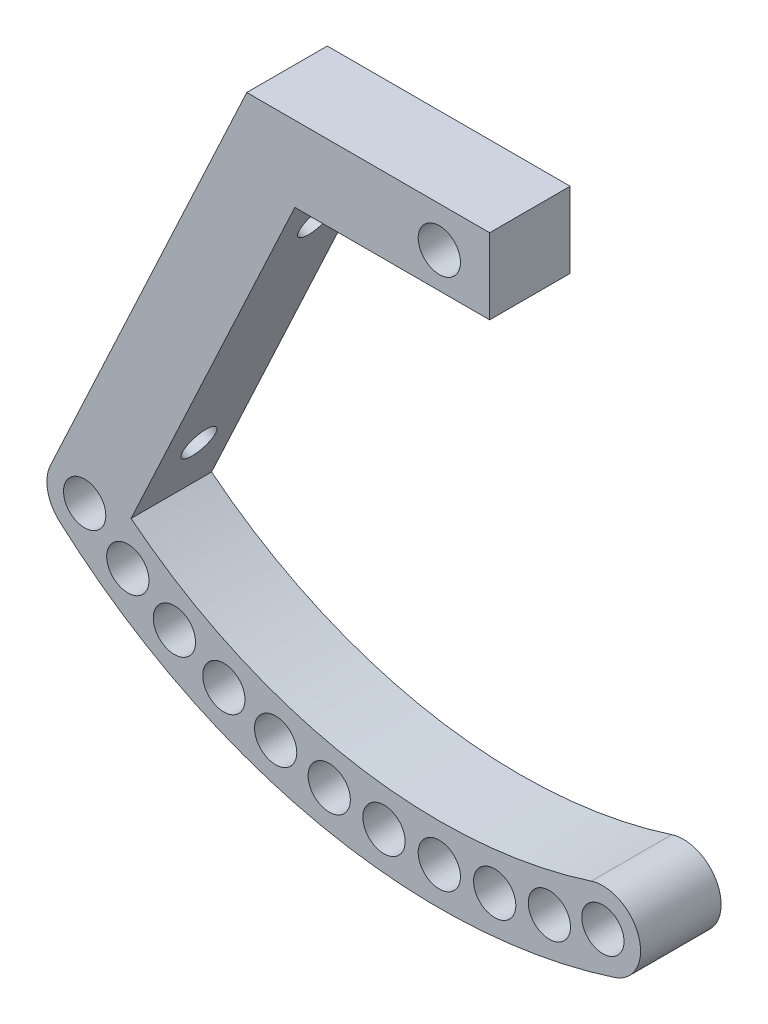
ISO-10303-21;
HEADER;
FILE_DESCRIPTION(('STEP AP214'),'2;1');
FILE_NAME('part.step','',(''),(''),'','','');
FILE_SCHEMA(('AUTOMOTIVE_DESIGN { 1 0 10303 214 1 1 1 1 }'));
ENDSEC;
DATA;
#1=APPLICATION_CONTEXT('core data for automotive mechanical design processes');
#2=APPLICATION_PROTOCOL_DEFINITION('international standard','automotive_design',2000,#1);
#3=PRODUCT_CONTEXT('',#1,'mechanical');
#4=PRODUCT('Part','Part','',(#3));
#5=PRODUCT_RELATED_PRODUCT_CATEGORY('part','',(#4));
#6=PRODUCT_DEFINITION_FORMATION('','',#4);
#7=PRODUCT_DEFINITION_CONTEXT('part definition',#1,'design');
#8=PRODUCT_DEFINITION('design','',#6,#7);
#9=PRODUCT_DEFINITION_SHAPE('','',#8);
#10=(LENGTH_UNIT() NAMED_UNIT(*) SI_UNIT(.MILLI.,.METRE.));
#11=(NAMED_UNIT(*) PLANE_ANGLE_UNIT() SI_UNIT($,.RADIAN.));
#12=(NAMED_UNIT(*) SI_UNIT($,.STERADIAN.) SOLID_ANGLE_UNIT());
#13=UNCERTAINTY_MEASURE_WITH_UNIT(LENGTH_MEASURE(1.E-05),#10,'distance_accuracy_value','');
#14=(GEOMETRIC_REPRESENTATION_CONTEXT(3) GLOBAL_UNCERTAINTY_ASSIGNED_CONTEXT((#13)) GLOBAL_UNIT_ASSIGNED_CONTEXT((#10,
#11,#12)) REPRESENTATION_CONTEXT('',''));
#15=CARTESIAN_POINT('',(0.,0.,0.));
#16=DIRECTION('',(0.,0.,1.));
#17=DIRECTION('',(1.,0.,0.));
#18=AXIS2_PLACEMENT_3D('',#15,#16,#17);
#19=CARTESIAN_POINT('',(-46.3566792332797,21.616474533113,8.));
#20=DIRECTION('',(0.906307787036651,-0.422618261740697,0.));
#21=DIRECTION('',(0.422618261740697,0.906307787036651,0.));
#22=AXIS2_PLACEMENT_3D('',#19,#20,#21);
#23=PLANE('',#22);
#24=CARTESIAN_POINT('',(-23.094691175394,71.5019689080599,4.));
#25=DIRECTION('',(-0.906307787036651,0.422618261740697,0.));
#26=DIRECTION('',(-0.422618261740697,-0.906307787036651,0.));
#27=AXIS2_PLACEMENT_3D('',#24,#25,#26);
#28=CIRCLE('',#27,1.65);
#29=CARTESIAN_POINT('',(-23.7920113072661,70.0065610594495,4.));
#30=VERTEX_POINT('',#29);
#31=EDGE_CURVE('E178',#30,#30,#28,.T.);
#32=ORIENTED_EDGE('',*,*,#31,.F.);
#33=EDGE_LOOP('',(#32));
#34=FACE_BOUND('',#33,.T.);
#35=CARTESIAN_POINT('',(-34.6744315470891,46.6691355432557,4.));
#36=DIRECTION('',(-0.906307787036651,0.422618261740697,0.));
#37=DIRECTION('',(-0.422618261740697,-0.906307787036651,0.));
#38=AXIS2_PLACEMENT_3D('',#35,#36,#37);
#39=CIRCLE('',#38,1.65);
#40=CARTESIAN_POINT('',(-35.3717516789612,45.1737276946452,4.));
#41=VERTEX_POINT('',#40);
#42=EDGE_CURVE('E267',#41,#41,#39,.T.);
#43=ORIENTED_EDGE('',*,*,#42,.F.);
#44=EDGE_LOOP('',(#43));
#45=FACE_BOUND('',#44,.T.);
#46=DIRECTION('',(-0.422618261740697,-0.906307787036651,0.));
#47=VECTOR('',#46,1.);
#48=CARTESIAN_POINT('',(-46.3566792332797,21.616474533113,0.));
#49=LINE('',#48,#47);
#50=CARTESIAN_POINT('',(-19.131994197983,80.,0.));
#51=VERTEX_POINT('',#50);
#52=CARTESIAN_POINT('',(-38.6371285245,38.1711044513156,0.));
#53=VERTEX_POINT('',#52);
#54=EDGE_CURVE('E177',#51,#53,#49,.T.);
#55=ORIENTED_EDGE('',*,*,#54,.T.);
#56=DIRECTION('',(0.,0.,-1.));
#57=VECTOR('',#56,1.);
#58=CARTESIAN_POINT('',(-38.6371285245,38.1711044513156,8.));
#59=LINE('',#58,#57);
#60=CARTESIAN_POINT('',(-38.6371285245,38.1711044513156,8.));
#61=VERTEX_POINT('',#60);
#62=EDGE_CURVE('E11',#61,#53,#59,.T.);
#63=ORIENTED_EDGE('',*,*,#62,.F.);
#64=DIRECTION('',(-0.422618261740697,-0.906307787036651,0.));
#65=VECTOR('',#64,1.);
#66=CARTESIAN_POINT('',(-46.3566792332797,21.616474533113,8.));
#67=LINE('',#66,#65);
#68=CARTESIAN_POINT('',(-19.131994197983,80.,8.));
#69=VERTEX_POINT('',#68);
#70=EDGE_CURVE('E263',#69,#61,#67,.T.);
#71=ORIENTED_EDGE('',*,*,#70,.F.);
#72=DIRECTION('',(0.,0.,-1.));
#73=VECTOR('',#72,1.);
#74=CARTESIAN_POINT('',(-19.131994197983,80.,8.));
#75=LINE('',#74,#73);
#76=EDGE_CURVE('E173',#69,#51,#75,.T.);
#77=ORIENTED_EDGE('',*,*,#76,.T.);
#78=EDGE_LOOP('',(#55,#63,#71,#77));
#79=FACE_BOUND('',#78,.T.);
#80=ADVANCED_FACE('F35',(#34,#45,#79),#23,.F.);
#81=CARTESIAN_POINT('',(-35.2384743231125,36.586285969788,8.));
#82=DIRECTION('',(0.,0.,-1.));
#83=DIRECTION('',(-1.,0.,0.));
#84=AXIS2_PLACEMENT_3D('',#81,#82,#83);
#85=CYLINDRICAL_SURFACE('',#84,3.75);
#86=CARTESIAN_POINT('',(-35.2384743231125,36.586285969788,0.));
#87=DIRECTION('',(0.,0.,1.));
#88=DIRECTION('',(1.,0.,0.));
#89=AXIS2_PLACEMENT_3D('',#86,#87,#88);
#90=CIRCLE('',#89,3.75);
#91=CARTESIAN_POINT('',(-37.7379138053234,33.7906997567076,0.));
#92=VERTEX_POINT('',#91);
#93=EDGE_CURVE('E181',#53,#92,#90,.T.);
#94=ORIENTED_EDGE('',*,*,#93,.T.);
#95=DIRECTION('',(0.,0.,-1.));
#96=VECTOR('',#95,1.);
#97=CARTESIAN_POINT('',(-37.7379138053234,33.7906997567076,8.));
#98=LINE('',#97,#96);
#99=CARTESIAN_POINT('',(-37.7379138053234,33.7906997567076,8.));
#100=VERTEX_POINT('',#99);
#101=EDGE_CURVE('E44',#100,#92,#98,.T.);
#102=ORIENTED_EDGE('',*,*,#101,.F.);
#103=CARTESIAN_POINT('',(-35.2384743231125,36.586285969788,8.));
#104=DIRECTION('',(0.,0.,1.));
#105=DIRECTION('',(1.,0.,0.));
#106=AXIS2_PLACEMENT_3D('',#103,#104,#105);
#107=CIRCLE('',#106,3.75);
#108=EDGE_CURVE('E97',#61,#100,#107,.T.);
#109=ORIENTED_EDGE('',*,*,#108,.F.);
#110=ORIENTED_EDGE('',*,*,#62,.T.);
#111=EDGE_LOOP('',(#94,#102,#109,#110));
#112=FACE_BOUND('',#111,.T.);
#113=ADVANCED_FACE('F283',(#112),#85,.T.);
#114=CARTESIAN_POINT('',(0.,76.,8.));
#115=DIRECTION('',(0.,0.,-1.));
#116=DIRECTION('',(-1.,0.,0.));
#117=AXIS2_PLACEMENT_3D('',#114,#115,#116);
#118=CYLINDRICAL_SURFACE('',#117,56.6195652173913);
#119=CARTESIAN_POINT('',(0.,76.,0.));
#120=DIRECTION('',(0.,0.,1.));
#121=DIRECTION('',(1.,0.,0.));
#122=AXIS2_PLACEMENT_3D('',#119,#120,#121);
#123=CIRCLE('',#122,56.6195652173913);
#124=CARTESIAN_POINT('',(17.4001011967782,22.120396774398,0.));
#125=VERTEX_POINT('',#124);
#126=EDGE_CURVE('E183',#92,#125,#123,.T.);
#127=ORIENTED_EDGE('',*,*,#126,.T.);
#128=DIRECTION('',(0.,0.,-1.));
#129=VECTOR('',#128,1.);
#130=CARTESIAN_POINT('',(17.4001011967782,22.120396774398,8.));
#131=LINE('',#130,#129);
#132=CARTESIAN_POINT('',(17.4001011967782,22.120396774398,8.));
#133=VERTEX_POINT('',#132);
#134=EDGE_CURVE('E238',#133,#125,#131,.T.);
#135=ORIENTED_EDGE('',*,*,#134,.F.);
#136=CARTESIAN_POINT('',(0.,76.,8.));
#137=DIRECTION('',(0.,0.,1.));
#138=DIRECTION('',(1.,0.,0.));
#139=AXIS2_PLACEMENT_3D('',#136,#137,#138);
#140=CIRCLE('',#139,56.6195652173913);
#141=EDGE_CURVE('E246',#100,#133,#140,.T.);
#142=ORIENTED_EDGE('',*,*,#141,.F.);
#143=ORIENTED_EDGE('',*,*,#101,.T.);
#144=EDGE_LOOP('',(#127,#135,#142,#143));
#145=FACE_BOUND('',#144,.T.);
#146=ADVANCED_FACE('F244',(#145),#118,.T.);
#147=CARTESIAN_POINT('',(16.2476660052082,25.6889249204592,8.));
#148=DIRECTION('',(0.,0.,-1.));
#149=DIRECTION('',(-1.,0.,0.));
#150=AXIS2_PLACEMENT_3D('',#147,#148,#149);
#151=CYLINDRICAL_SURFACE('',#150,3.75);
#152=CARTESIAN_POINT('',(16.2476660052082,25.6889249204592,0.));
#153=DIRECTION('',(0.,0.,1.));
#154=DIRECTION('',(1.,0.,0.));
#155=AXIS2_PLACEMENT_3D('',#152,#153,#154);
#156=CIRCLE('',#155,3.75);
#157=CARTESIAN_POINT('',(15.0952308136381,29.2574530665203,0.));
#158=VERTEX_POINT('',#157);
#159=EDGE_CURVE('E185',#125,#158,#156,.T.);
#160=ORIENTED_EDGE('',*,*,#159,.T.);
#161=DIRECTION('',(0.,0.,-1.));
#162=VECTOR('',#161,1.);
#163=CARTESIAN_POINT('',(15.0952308136381,29.2574530665203,8.));
#164=LINE('',#163,#162);
#165=CARTESIAN_POINT('',(15.0952308136381,29.2574530665203,8.));
#166=VERTEX_POINT('',#165);
#167=EDGE_CURVE('E236',#166,#158,#164,.T.);
#168=ORIENTED_EDGE('',*,*,#167,.F.);
#169=CARTESIAN_POINT('',(16.2476660052082,25.6889249204592,8.));
#170=DIRECTION('',(0.,0.,1.));
#171=DIRECTION('',(1.,0.,0.));
#172=AXIS2_PLACEMENT_3D('',#169,#170,#171);
#173=CIRCLE('',#172,3.75);
#174=EDGE_CURVE('E258',#133,#166,#173,.T.);
#175=ORIENTED_EDGE('',*,*,#174,.F.);
#176=ORIENTED_EDGE('',*,*,#134,.T.);
#177=EDGE_LOOP('',(#160,#168,#175,#176));
#178=FACE_BOUND('',#177,.T.);
#179=ADVANCED_FACE('F255',(#178),#151,.T.);
#180=CARTESIAN_POINT('',(0.,76.,8.));
#181=DIRECTION('',(0.,0.,-1.));
#182=DIRECTION('',(-1.,0.,0.));
#183=AXIS2_PLACEMENT_3D('',#180,#181,#182);
#184=CYLINDRICAL_SURFACE('',#183,49.1195652173913);
#185=CARTESIAN_POINT('',(0.,76.,0.));
#186=DIRECTION('',(0.,0.,1.));
#187=DIRECTION('',(1.,0.,0.));
#188=AXIS2_PLACEMENT_3D('',#185,#186,#187);
#189=CIRCLE('',#188,49.1195652173913);
#190=CARTESIAN_POINT('',(-30.6285068063964,37.5991372758881,0.));
#191=VERTEX_POINT('',#190);
#192=EDGE_CURVE('E188',#191,#158,#189,.T.);
#193=ORIENTED_EDGE('',*,*,#192,.F.);
#194=DIRECTION('',(0.,0.,-1.));
#195=VECTOR('',#194,1.);
#196=CARTESIAN_POINT('',(-30.6285068063964,37.5991372758881,8.));
#197=LINE('',#196,#195);
#198=CARTESIAN_POINT('',(-30.6285068063964,37.5991372758881,8.));
#199=VERTEX_POINT('',#198);
#200=EDGE_CURVE('E234',#199,#191,#197,.T.);
#201=ORIENTED_EDGE('',*,*,#200,.F.);
#202=CARTESIAN_POINT('',(0.,76.,8.));
#203=DIRECTION('',(0.,0.,1.));
#204=DIRECTION('',(1.,0.,0.));
#205=AXIS2_PLACEMENT_3D('',#202,#203,#204);
#206=CIRCLE('',#205,49.1195652173913);
#207=EDGE_CURVE('E135',#199,#166,#206,.T.);
#208=ORIENTED_EDGE('',*,*,#207,.T.);
#209=ORIENTED_EDGE('',*,*,#167,.T.);
#210=EDGE_LOOP('',(#193,#201,#208,#209));
#211=FACE_BOUND('',#210,.T.);
#212=ADVANCED_FACE('F292',(#211),#184,.F.);
#213=CARTESIAN_POINT('',(-39.5593708305048,18.4468375700577,8.));
#214=DIRECTION('',(0.906307787036651,-0.422618261740697,0.));
#215=DIRECTION('',(0.422618261740697,0.906307787036651,0.));
#216=AXIS2_PLACEMENT_3D('',#213,#214,#215);
#217=PLANE('',#216);
#218=CARTESIAN_POINT('',(-16.2973827726191,68.3323319450047,4.));
#219=DIRECTION('',(0.906307787036651,-0.422618261740697,0.));
#220=DIRECTION('',(0.422618261740697,0.906307787036651,0.));
#221=AXIS2_PLACEMENT_3D('',#218,#219,#220);
#222=CIRCLE('',#221,1.65);
#223=CARTESIAN_POINT('',(-15.6000626407469,69.8277397936152,4.));
#224=VERTEX_POINT('',#223);
#225=EDGE_CURVE('E270',#224,#224,#222,.F.);
#226=ORIENTED_EDGE('',*,*,#225,.T.);
#227=EDGE_LOOP('',(#226));
#228=FACE_BOUND('',#227,.T.);
#229=CARTESIAN_POINT('',(-27.8771231443142,43.4994985802004,4.));
#230=DIRECTION('',(0.906307787036651,-0.422618261740697,0.));
#231=DIRECTION('',(0.422618261740697,0.906307787036651,0.));
#232=AXIS2_PLACEMENT_3D('',#229,#230,#231);
#233=CIRCLE('',#232,1.65);
#234=CARTESIAN_POINT('',(-27.179803012442,44.9949064288109,4.));
#235=VERTEX_POINT('',#234);
#236=EDGE_CURVE('E271',#235,#235,#233,.F.);
#237=ORIENTED_EDGE('',*,*,#236,.T.);
#238=EDGE_LOOP('',(#237));
#239=FACE_BOUND('',#238,.T.);
#240=DIRECTION('',(-0.422618261740697,-0.906307787036651,0.));
#241=VECTOR('',#240,1.);
#242=CARTESIAN_POINT('',(-39.5593708305048,18.4468375700577,0.));
#243=LINE('',#242,#241);
#244=CARTESIAN_POINT('',(-14.3539672419268,72.5,0.));
#245=VERTEX_POINT('',#244);
#246=EDGE_CURVE('E191',#245,#191,#243,.T.);
#247=ORIENTED_EDGE('',*,*,#246,.F.);
#248=DIRECTION('',(0.,0.,-1.));
#249=VECTOR('',#248,1.);
#250=CARTESIAN_POINT('',(-14.3539672419268,72.5,8.));
#251=LINE('',#250,#249);
#252=CARTESIAN_POINT('',(-14.3539672419268,72.5,8.));
#253=VERTEX_POINT('',#252);
#254=EDGE_CURVE('E122',#253,#245,#251,.T.);
#255=ORIENTED_EDGE('',*,*,#254,.F.);
#256=DIRECTION('',(-0.422618261740697,-0.906307787036651,0.));
#257=VECTOR('',#256,1.);
#258=CARTESIAN_POINT('',(-39.5593708305048,18.4468375700577,8.));
#259=LINE('',#258,#257);
#260=EDGE_CURVE('E133',#253,#199,#259,.T.);
#261=ORIENTED_EDGE('',*,*,#260,.T.);
#262=ORIENTED_EDGE('',*,*,#200,.T.);
#263=EDGE_LOOP('',(#247,#255,#261,#262));
#264=FACE_BOUND('',#263,.T.);
#265=ADVANCED_FACE('F290',(#228,#239,#264),#217,.T.);
#266=CARTESIAN_POINT('',(0.,72.5,8.));
#267=DIRECTION('',(0.,-1.,0.));
#268=DIRECTION('',(0.,0.,-1.));
#269=AXIS2_PLACEMENT_3D('',#266,#267,#268);
#270=PLANE('',#269);
#271=DIRECTION('',(-1.,0.,0.));
#272=VECTOR('',#271,1.);
#273=CARTESIAN_POINT('',(0.,72.5,0.));
#274=LINE('',#273,#272);
#275=CARTESIAN_POINT('',(5.00000000000002,72.5,0.));
#276=VERTEX_POINT('',#275);
#277=EDGE_CURVE('E121',#276,#245,#274,.T.);
#278=ORIENTED_EDGE('',*,*,#277,.F.);
#279=DIRECTION('',(0.,0.,-1.));
#280=VECTOR('',#279,1.);
#281=CARTESIAN_POINT('',(5.00000000000002,72.5,8.));
#282=LINE('',#281,#280);
#283=CARTESIAN_POINT('',(5.00000000000002,72.5,8.));
#284=VERTEX_POINT('',#283);
#285=EDGE_CURVE('E115',#284,#276,#282,.T.);
#286=ORIENTED_EDGE('',*,*,#285,.F.);
#287=DIRECTION('',(-1.,0.,0.));
#288=VECTOR('',#287,1.);
#289=CARTESIAN_POINT('',(0.,72.5,8.));
#290=LINE('',#289,#288);
#291=EDGE_CURVE('E119',#284,#253,#290,.T.);
#292=ORIENTED_EDGE('',*,*,#291,.T.);
#293=ORIENTED_EDGE('',*,*,#254,.T.);
#294=EDGE_LOOP('',(#278,#286,#292,#293));
#295=FACE_BOUND('',#294,.T.);
#296=ADVANCED_FACE('F117',(#295),#270,.T.);
#297=CARTESIAN_POINT('',(5.00000000000004,0.,8.));
#298=DIRECTION('',(-1.,0.,0.));
#299=DIRECTION('',(0.,-1.,0.));
#300=AXIS2_PLACEMENT_3D('',#297,#298,#299);
#301=PLANE('',#300);
#302=DIRECTION('',(0.,1.,0.));
#303=VECTOR('',#302,1.);
#304=CARTESIAN_POINT('',(5.00000000000004,0.,0.));
#305=LINE('',#304,#303);
#306=CARTESIAN_POINT('',(5.00000000000002,80.,0.));
#307=VERTEX_POINT('',#306);
#308=EDGE_CURVE('E83',#276,#307,#305,.T.);
#309=ORIENTED_EDGE('',*,*,#308,.T.);
#310=DIRECTION('',(0.,0.,-1.));
#311=VECTOR('',#310,1.);
#312=CARTESIAN_POINT('',(5.00000000000002,80.,8.));
#313=LINE('',#312,#311);
#314=CARTESIAN_POINT('',(5.00000000000002,80.,8.));
#315=VERTEX_POINT('',#314);
#316=EDGE_CURVE('E123',#315,#307,#313,.T.);
#317=ORIENTED_EDGE('',*,*,#316,.F.);
#318=DIRECTION('',(0.,1.,0.));
#319=VECTOR('',#318,1.);
#320=CARTESIAN_POINT('',(5.00000000000004,0.,8.));
#321=LINE('',#320,#319);
#322=EDGE_CURVE('E125',#284,#315,#321,.T.);
#323=ORIENTED_EDGE('',*,*,#322,.F.);
#324=ORIENTED_EDGE('',*,*,#285,.T.);
#325=EDGE_LOOP('',(#309,#317,#323,#324));
#326=FACE_BOUND('',#325,.T.);
#327=ADVANCED_FACE('F126',(#326),#301,.F.);
#328=CARTESIAN_POINT('',(-1.86358382478583E-13,23.1304347826087,8.));
#329=DIRECTION('',(0.,0.,-1.));
#330=DIRECTION('',(-1.,0.,0.));
#331=AXIS2_PLACEMENT_3D('',#328,#329,#330);
#332=CYLINDRICAL_SURFACE('',#331,2.1);
#333=CARTESIAN_POINT('',(-1.86358382478583E-13,23.1304347826087,8.));
#334=DIRECTION('',(0.,0.,1.));
#335=DIRECTION('',(1.,0.,0.));
#336=AXIS2_PLACEMENT_3D('',#333,#334,#335);
#337=CIRCLE('',#336,2.1);
#338=CARTESIAN_POINT('',(2.09999999999981,23.1304347826087,8.));
#339=VERTEX_POINT('',#338);
#340=EDGE_CURVE('E167',#339,#339,#337,.T.);
#341=ORIENTED_EDGE('',*,*,#340,.T.);
#342=EDGE_LOOP('',(#341));
#343=FACE_BOUND('',#342,.T.);
#344=CARTESIAN_POINT('',(-1.86358382478583E-13,23.1304347826087,0.));
#345=DIRECTION('',(0.,0.,1.));
#346=DIRECTION('',(1.,0.,0.));
#347=AXIS2_PLACEMENT_3D('',#344,#345,#346);
#348=CIRCLE('',#347,2.1);
#349=CARTESIAN_POINT('',(2.09999999999981,23.1304347826087,0.));
#350=VERTEX_POINT('',#349);
#351=EDGE_CURVE('E224',#350,#350,#348,.T.);
#352=ORIENTED_EDGE('',*,*,#351,.F.);
#353=EDGE_LOOP('',(#352));
#354=FACE_BOUND('',#353,.T.);
#355=ADVANCED_FACE('F340',(#343,#354),#332,.F.);
#356=CARTESIAN_POINT('',(16.2476660052082,25.6889249204592,8.));
#357=DIRECTION('',(0.,0.,-1.));
#358=DIRECTION('',(-1.,0.,0.));
#359=AXIS2_PLACEMENT_3D('',#356,#357,#358);
#360=CYLINDRICAL_SURFACE('',#359,2.1);
#361=CARTESIAN_POINT('',(16.2476660052082,25.6889249204592,8.));
#362=DIRECTION('',(0.,0.,1.));
#363=DIRECTION('',(1.,0.,0.));
#364=AXIS2_PLACEMENT_3D('',#361,#362,#363);
#365=CIRCLE('',#364,2.1);
#366=CARTESIAN_POINT('',(18.3476660052082,25.6889249204592,8.));
#367=VERTEX_POINT('',#366);
#368=EDGE_CURVE('E164',#367,#367,#365,.T.);
#369=ORIENTED_EDGE('',*,*,#368,.T.);
#370=EDGE_LOOP('',(#369));
#371=FACE_BOUND('',#370,.T.);
#372=CARTESIAN_POINT('',(16.2476660052082,25.6889249204592,0.));
#373=DIRECTION('',(0.,0.,1.));
#374=DIRECTION('',(1.,0.,0.));
#375=AXIS2_PLACEMENT_3D('',#372,#373,#374);
#376=CIRCLE('',#375,2.1);
#377=CARTESIAN_POINT('',(18.3476660052082,25.6889249204592,0.));
#378=VERTEX_POINT('',#377);
#379=EDGE_CURVE('E221',#378,#378,#376,.T.);
#380=ORIENTED_EDGE('',*,*,#379,.F.);
#381=EDGE_LOOP('',(#380));
#382=FACE_BOUND('',#381,.T.);
#383=ADVANCED_FACE('F349',(#371,#382),#360,.F.);
#384=CARTESIAN_POINT('',(-5.5,23.4172944184498,8.));
#385=DIRECTION('',(0.,0.,-1.));
#386=DIRECTION('',(-1.,0.,0.));
#387=AXIS2_PLACEMENT_3D('',#384,#385,#386);
#388=CYLINDRICAL_SURFACE('',#387,2.1);
#389=CARTESIAN_POINT('',(-5.5,23.4172944184498,8.));
#390=DIRECTION('',(0.,0.,1.));
#391=DIRECTION('',(1.,0.,0.));
#392=AXIS2_PLACEMENT_3D('',#389,#390,#391);
#393=CIRCLE('',#392,2.1);
#394=CARTESIAN_POINT('',(-3.39999999999999,23.4172944184498,8.));
#395=VERTEX_POINT('',#394);
#396=EDGE_CURVE('E161',#395,#395,#393,.T.);
#397=ORIENTED_EDGE('',*,*,#396,.T.);
#398=EDGE_LOOP('',(#397));
#399=FACE_BOUND('',#398,.T.);
#400=CARTESIAN_POINT('',(-5.5,23.4172944184498,0.));
#401=DIRECTION('',(0.,0.,1.));
#402=DIRECTION('',(1.,0.,0.));
#403=AXIS2_PLACEMENT_3D('',#400,#401,#402);
#404=CIRCLE('',#403,2.1);
#405=CARTESIAN_POINT('',(-3.39999999999999,23.4172944184498,0.));
#406=VERTEX_POINT('',#405);
#407=EDGE_CURVE('E218',#406,#406,#404,.T.);
#408=ORIENTED_EDGE('',*,*,#407,.F.);
#409=EDGE_LOOP('',(#408));
#410=FACE_BOUND('',#409,.T.);
#411=ADVANCED_FACE('F359',(#399,#410),#388,.F.);
#412=CARTESIAN_POINT('',(-10.940316210635,24.2747604405034,8.));
#413=DIRECTION('',(0.,0.,-1.));
#414=DIRECTION('',(-1.,0.,0.));
#415=AXIS2_PLACEMENT_3D('',#412,#413,#414);
#416=CYLINDRICAL_SURFACE('',#415,2.1);
#417=CARTESIAN_POINT('',(-10.940316210635,24.2747604405034,8.));
#418=DIRECTION('',(0.,0.,1.));
#419=DIRECTION('',(1.,0.,0.));
#420=AXIS2_PLACEMENT_3D('',#417,#418,#419);
#421=CIRCLE('',#420,2.1);
#422=CARTESIAN_POINT('',(-8.84031621063503,24.2747604405034,8.));
#423=VERTEX_POINT('',#422);
#424=EDGE_CURVE('E158',#423,#423,#421,.T.);
#425=ORIENTED_EDGE('',*,*,#424,.T.);
#426=EDGE_LOOP('',(#425));
#427=FACE_BOUND('',#426,.T.);
#428=CARTESIAN_POINT('',(-10.940316210635,24.2747604405034,0.));
#429=DIRECTION('',(0.,0.,1.));
#430=DIRECTION('',(1.,0.,0.));
#431=AXIS2_PLACEMENT_3D('',#428,#429,#430);
#432=CIRCLE('',#431,2.1);
#433=CARTESIAN_POINT('',(-8.84031621063503,24.2747604405034,0.));
#434=VERTEX_POINT('',#433);
#435=EDGE_CURVE('E215',#434,#434,#432,.T.);
#436=ORIENTED_EDGE('',*,*,#435,.F.);
#437=EDGE_LOOP('',(#436));
#438=FACE_BOUND('',#437,.T.);
#439=ADVANCED_FACE('F369',(#427,#438),#416,.F.);
#440=CARTESIAN_POINT('',(-16.2619125070334,25.6935279721428,8.));
#441=DIRECTION('',(0.,0.,-1.));
#442=DIRECTION('',(-1.,0.,0.));
#443=AXIS2_PLACEMENT_3D('',#440,#441,#442);
#444=CYLINDRICAL_SURFACE('',#443,2.1);
#445=CARTESIAN_POINT('',(-16.2619125070334,25.6935279721428,8.));
#446=DIRECTION('',(0.,0.,1.));
#447=DIRECTION('',(1.,0.,0.));
#448=AXIS2_PLACEMENT_3D('',#445,#446,#447);
#449=CIRCLE('',#448,2.1);
#450=CARTESIAN_POINT('',(-14.1619125070334,25.6935279721428,8.));
#451=VERTEX_POINT('',#450);
#452=EDGE_CURVE('E155',#451,#451,#449,.T.);
#453=ORIENTED_EDGE('',*,*,#452,.T.);
#454=EDGE_LOOP('',(#453));
#455=FACE_BOUND('',#454,.T.);
#456=CARTESIAN_POINT('',(-16.2619125070334,25.6935279721428,0.));
#457=DIRECTION('',(0.,0.,1.));
#458=DIRECTION('',(1.,0.,0.));
#459=AXIS2_PLACEMENT_3D('',#456,#457,#458);
#460=CIRCLE('',#459,2.1);
#461=CARTESIAN_POINT('',(-14.1619125070334,25.6935279721428,0.));
#462=VERTEX_POINT('',#461);
#463=EDGE_CURVE('E212',#462,#462,#460,.T.);
#464=ORIENTED_EDGE('',*,*,#463,.F.);
#465=EDGE_LOOP('',(#464));
#466=FACE_BOUND('',#465,.T.);
#467=ADVANCED_FACE('F379',(#455,#466),#444,.F.);
#468=CARTESIAN_POINT('',(-21.4070410651152,27.6582011183648,8.));
#469=DIRECTION('',(0.,0.,-1.));
#470=DIRECTION('',(-1.,0.,0.));
#471=AXIS2_PLACEMENT_3D('',#468,#469,#470);
#472=CYLINDRICAL_SURFACE('',#471,2.10000000000003);
#473=CARTESIAN_POINT('',(-21.4070410651152,27.6582011183648,8.));
#474=DIRECTION('',(0.,0.,1.));
#475=DIRECTION('',(1.,0.,0.));
#476=AXIS2_PLACEMENT_3D('',#473,#474,#475);
#477=CIRCLE('',#476,2.10000000000003);
#478=CARTESIAN_POINT('',(-19.3070410651152,27.6582011183648,8.));
#479=VERTEX_POINT('',#478);
#480=EDGE_CURVE('E152',#479,#479,#477,.T.);
#481=ORIENTED_EDGE('',*,*,#480,.T.);
#482=EDGE_LOOP('',(#481));
#483=FACE_BOUND('',#482,.T.);
#484=CARTESIAN_POINT('',(-21.4070410651152,27.6582011183648,0.));
#485=DIRECTION('',(0.,0.,1.));
#486=DIRECTION('',(1.,0.,0.));
#487=AXIS2_PLACEMENT_3D('',#484,#485,#486);
#488=CIRCLE('',#487,2.10000000000003);
#489=CARTESIAN_POINT('',(-19.3070410651152,27.6582011183648,0.));
#490=VERTEX_POINT('',#489);
#491=EDGE_CURVE('E209',#490,#490,#488,.T.);
#492=ORIENTED_EDGE('',*,*,#491,.F.);
#493=EDGE_LOOP('',(#492));
#494=FACE_BOUND('',#493,.T.);
#495=ADVANCED_FACE('F389',(#483,#494),#472,.F.);
#496=CARTESIAN_POINT('',(-26.3198690177684,30.147460035855,8.));
#497=DIRECTION('',(0.,0.,-1.));
#498=DIRECTION('',(-1.,0.,0.));
#499=AXIS2_PLACEMENT_3D('',#496,#497,#498);
#500=CYLINDRICAL_SURFACE('',#499,2.10000000000001);
#501=CARTESIAN_POINT('',(-26.3198690177684,30.147460035855,8.));
#502=DIRECTION('',(0.,0.,1.));
#503=DIRECTION('',(1.,0.,0.));
#504=AXIS2_PLACEMENT_3D('',#501,#502,#503);
#505=CIRCLE('',#504,2.10000000000001);
#506=CARTESIAN_POINT('',(-24.2198690177684,30.147460035855,8.));
#507=VERTEX_POINT('',#506);
#508=EDGE_CURVE('E149',#507,#507,#505,.T.);
#509=ORIENTED_EDGE('',*,*,#508,.T.);
#510=EDGE_LOOP('',(#509));
#511=FACE_BOUND('',#510,.T.);
#512=CARTESIAN_POINT('',(-26.3198690177684,30.147460035855,0.));
#513=DIRECTION('',(0.,0.,1.));
#514=DIRECTION('',(1.,0.,0.));
#515=AXIS2_PLACEMENT_3D('',#512,#513,#514);
#516=CIRCLE('',#515,2.10000000000001);
#517=CARTESIAN_POINT('',(-24.2198690177684,30.147460035855,0.));
#518=VERTEX_POINT('',#517);
#519=EDGE_CURVE('E206',#518,#518,#516,.T.);
#520=ORIENTED_EDGE('',*,*,#519,.F.);
#521=EDGE_LOOP('',(#520));
#522=FACE_BOUND('',#521,.T.);
#523=ADVANCED_FACE('F399',(#511,#522),#500,.F.);
#524=CARTESIAN_POINT('',(10.9329922918172,24.273211912752,8.));
#525=DIRECTION('',(0.,0.,-1.));
#526=DIRECTION('',(-1.,0.,0.));
#527=AXIS2_PLACEMENT_3D('',#524,#525,#526);
#528=CYLINDRICAL_SURFACE('',#527,2.1);
#529=CARTESIAN_POINT('',(10.9329922918172,24.273211912752,8.));
#530=DIRECTION('',(0.,0.,1.));
#531=DIRECTION('',(1.,0.,0.));
#532=AXIS2_PLACEMENT_3D('',#529,#530,#531);
#533=CIRCLE('',#532,2.1);
#534=CARTESIAN_POINT('',(13.0329922918172,24.273211912752,8.));
#535=VERTEX_POINT('',#534);
#536=EDGE_CURVE('E146',#535,#535,#533,.T.);
#537=ORIENTED_EDGE('',*,*,#536,.T.);
#538=EDGE_LOOP('',(#537));
#539=FACE_BOUND('',#538,.T.);
#540=CARTESIAN_POINT('',(10.9329922918172,24.273211912752,0.));
#541=DIRECTION('',(0.,0.,1.));
#542=DIRECTION('',(1.,0.,0.));
#543=AXIS2_PLACEMENT_3D('',#540,#541,#542);
#544=CIRCLE('',#543,2.1);
#545=CARTESIAN_POINT('',(13.0329922918172,24.273211912752,0.));
#546=VERTEX_POINT('',#545);
#547=EDGE_CURVE('E203',#546,#546,#544,.T.);
#548=ORIENTED_EDGE('',*,*,#547,.F.);
#549=EDGE_LOOP('',(#548));
#550=FACE_BOUND('',#549,.T.);
#551=ADVANCED_FACE('F409',(#539,#550),#528,.F.);
#552=CARTESIAN_POINT('',(-35.2384743231125,36.586285969788,8.));
#553=DIRECTION('',(0.,0.,-1.));
#554=DIRECTION('',(-1.,0.,0.));
#555=AXIS2_PLACEMENT_3D('',#552,#553,#554);
#556=CYLINDRICAL_SURFACE('',#555,2.10000000000001);
#557=CARTESIAN_POINT('',(-35.2384743231125,36.586285969788,8.));
#558=DIRECTION('',(0.,0.,1.));
#559=DIRECTION('',(1.,0.,0.));
#560=AXIS2_PLACEMENT_3D('',#557,#558,#559);
#561=CIRCLE('',#560,2.10000000000001);
#562=CARTESIAN_POINT('',(-33.1384743231125,36.586285969788,8.));
#563=VERTEX_POINT('',#562);
#564=EDGE_CURVE('E143',#563,#563,#561,.T.);
#565=ORIENTED_EDGE('',*,*,#564,.T.);
#566=EDGE_LOOP('',(#565));
#567=FACE_BOUND('',#566,.T.);
#568=CARTESIAN_POINT('',(-35.2384743231125,36.586285969788,0.));
#569=DIRECTION('',(0.,0.,1.));
#570=DIRECTION('',(1.,0.,0.));
#571=AXIS2_PLACEMENT_3D('',#568,#569,#570);
#572=CIRCLE('',#571,2.10000000000001);
#573=CARTESIAN_POINT('',(-33.1384743231125,36.586285969788,0.));
#574=VERTEX_POINT('',#573);
#575=EDGE_CURVE('E200',#574,#574,#572,.T.);
#576=ORIENTED_EDGE('',*,*,#575,.F.);
#577=EDGE_LOOP('',(#576));
#578=FACE_BOUND('',#577,.T.);
#579=ADVANCED_FACE('F419',(#567,#578),#556,.F.);
#580=CARTESIAN_POINT('',(0.,76.,8.));
#581=DIRECTION('',(0.,0.,-1.));
#582=DIRECTION('',(-1.,0.,0.));
#583=AXIS2_PLACEMENT_3D('',#580,#581,#582);
#584=CYLINDRICAL_SURFACE('',#583,2.09999999999985);
#585=CARTESIAN_POINT('',(0.,76.,8.));
#586=DIRECTION('',(0.,0.,1.));
#587=DIRECTION('',(1.,0.,0.));
#588=AXIS2_PLACEMENT_3D('',#585,#586,#587);
#589=CIRCLE('',#588,2.09999999999985);
#590=CARTESIAN_POINT('',(2.09999999999985,76.,8.));
#591=VERTEX_POINT('',#590);
#592=EDGE_CURVE('E140',#591,#591,#589,.T.);
#593=ORIENTED_EDGE('',*,*,#592,.T.);
#594=EDGE_LOOP('',(#593));
#595=FACE_BOUND('',#594,.T.);
#596=CARTESIAN_POINT('',(0.,76.,0.));
#597=DIRECTION('',(0.,0.,1.));
#598=DIRECTION('',(1.,0.,0.));
#599=AXIS2_PLACEMENT_3D('',#596,#597,#598);
#600=CIRCLE('',#599,2.09999999999985);
#601=CARTESIAN_POINT('',(2.09999999999985,76.,0.));
#602=VERTEX_POINT('',#601);
#603=EDGE_CURVE('E197',#602,#602,#600,.T.);
#604=ORIENTED_EDGE('',*,*,#603,.F.);
#605=EDGE_LOOP('',(#604));
#606=FACE_BOUND('',#605,.T.);
#607=ADVANCED_FACE('F429',(#595,#606),#584,.F.);
#608=CARTESIAN_POINT('',(0.,80.,8.));
#609=DIRECTION('',(0.,-1.,0.));
#610=DIRECTION('',(0.,0.,-1.));
#611=AXIS2_PLACEMENT_3D('',#608,#609,#610);
#612=PLANE('',#611);
#613=DIRECTION('',(-1.,0.,0.));
#614=VECTOR('',#613,1.);
#615=CARTESIAN_POINT('',(0.,80.,0.));
#616=LINE('',#615,#614);
#617=EDGE_CURVE('E89',#307,#51,#616,.T.);
#618=ORIENTED_EDGE('',*,*,#617,.T.);
#619=ORIENTED_EDGE('',*,*,#76,.F.);
#620=DIRECTION('',(-1.,0.,0.));
#621=VECTOR('',#620,1.);
#622=CARTESIAN_POINT('',(0.,80.,8.));
#623=LINE('',#622,#621);
#624=EDGE_CURVE('E52',#315,#69,#623,.T.);
#625=ORIENTED_EDGE('',*,*,#624,.F.);
#626=ORIENTED_EDGE('',*,*,#316,.T.);
#627=EDGE_LOOP('',(#618,#619,#625,#626));
#628=FACE_BOUND('',#627,.T.);
#629=ADVANCED_FACE('F439',(#628),#612,.F.);
#630=CARTESIAN_POINT('',(-30.9470843306816,33.1342922873577,8.));
#631=DIRECTION('',(0.,0.,-1.));
#632=DIRECTION('',(-1.,0.,0.));
#633=AXIS2_PLACEMENT_3D('',#630,#631,#632);
#634=CYLINDRICAL_SURFACE('',#633,2.10000000000002);
#635=CARTESIAN_POINT('',(-30.9470843306816,33.1342922873577,8.));
#636=DIRECTION('',(0.,0.,1.));
#637=DIRECTION('',(1.,0.,0.));
#638=AXIS2_PLACEMENT_3D('',#635,#636,#637);
#639=CIRCLE('',#638,2.10000000000002);
#640=CARTESIAN_POINT('',(-28.8470843306815,33.1342922873577,8.));
#641=VERTEX_POINT('',#640);
#642=EDGE_CURVE('E230',#641,#641,#639,.T.);
#643=ORIENTED_EDGE('',*,*,#642,.T.);
#644=EDGE_LOOP('',(#643));
#645=FACE_BOUND('',#644,.T.);
#646=CARTESIAN_POINT('',(-30.9470843306816,33.1342922873577,0.));
#647=DIRECTION('',(0.,0.,1.));
#648=DIRECTION('',(1.,0.,0.));
#649=AXIS2_PLACEMENT_3D('',#646,#647,#648);
#650=CIRCLE('',#649,2.10000000000002);
#651=CARTESIAN_POINT('',(-28.8470843306815,33.1342922873577,0.));
#652=VERTEX_POINT('',#651);
#653=EDGE_CURVE('E174',#652,#652,#650,.T.);
#654=ORIENTED_EDGE('',*,*,#653,.F.);
#655=EDGE_LOOP('',(#654));
#656=FACE_BOUND('',#655,.T.);
#657=ADVANCED_FACE('F37',(#645,#656),#634,.F.);
#658=CARTESIAN_POINT('',(5.49999999999981,23.4172944184498,8.));
#659=DIRECTION('',(0.,0.,-1.));
#660=DIRECTION('',(-1.,0.,0.));
#661=AXIS2_PLACEMENT_3D('',#658,#659,#660);
#662=CYLINDRICAL_SURFACE('',#661,2.1);
#663=CARTESIAN_POINT('',(5.49999999999981,23.4172944184498,8.));
#664=DIRECTION('',(0.,0.,1.));
#665=DIRECTION('',(1.,0.,0.));
#666=AXIS2_PLACEMENT_3D('',#663,#664,#665);
#667=CIRCLE('',#666,2.1);
#668=CARTESIAN_POINT('',(7.59999999999981,23.4172944184498,8.));
#669=VERTEX_POINT('',#668);
#670=EDGE_CURVE('E170',#669,#669,#667,.T.);
#671=ORIENTED_EDGE('',*,*,#670,.T.);
#672=EDGE_LOOP('',(#671));
#673=FACE_BOUND('',#672,.T.);
#674=CARTESIAN_POINT('',(5.49999999999981,23.4172944184498,0.));
#675=DIRECTION('',(0.,0.,1.));
#676=DIRECTION('',(1.,0.,0.));
#677=AXIS2_PLACEMENT_3D('',#674,#675,#676);
#678=CIRCLE('',#677,2.1);
#679=CARTESIAN_POINT('',(7.59999999999981,23.4172944184498,0.));
#680=VERTEX_POINT('',#679);
#681=EDGE_CURVE('E227',#680,#680,#678,.T.);
#682=ORIENTED_EDGE('',*,*,#681,.F.);
#683=EDGE_LOOP('',(#682));
#684=FACE_BOUND('',#683,.T.);
#685=ADVANCED_FACE('F457',(#673,#684),#662,.F.);
#686=CARTESIAN_POINT('',(0.,0.,8.));
#687=DIRECTION('',(0.,0.,1.));
#688=DIRECTION('',(1.,0.,0.));
#689=AXIS2_PLACEMENT_3D('',#686,#687,#688);
#690=PLANE('',#689);
#691=ORIENTED_EDGE('',*,*,#642,.F.);
#692=EDGE_LOOP('',(#691));
#693=FACE_BOUND('',#692,.T.);
#694=ORIENTED_EDGE('',*,*,#70,.T.);
#695=ORIENTED_EDGE('',*,*,#108,.T.);
#696=ORIENTED_EDGE('',*,*,#141,.T.);
#697=ORIENTED_EDGE('',*,*,#174,.T.);
#698=ORIENTED_EDGE('',*,*,#207,.F.);
#699=ORIENTED_EDGE('',*,*,#260,.F.);
#700=ORIENTED_EDGE('',*,*,#291,.F.);
#701=ORIENTED_EDGE('',*,*,#322,.T.);
#702=ORIENTED_EDGE('',*,*,#624,.T.);
#703=EDGE_LOOP('',(#694,#695,#696,#697,#698,#699,#700,#701,#702));
#704=FACE_BOUND('',#703,.T.);
#705=ORIENTED_EDGE('',*,*,#592,.F.);
#706=EDGE_LOOP('',(#705));
#707=FACE_BOUND('',#706,.T.);
#708=ORIENTED_EDGE('',*,*,#564,.F.);
#709=EDGE_LOOP('',(#708));
#710=FACE_BOUND('',#709,.T.);
#711=ORIENTED_EDGE('',*,*,#536,.F.);
#712=EDGE_LOOP('',(#711));
#713=FACE_BOUND('',#712,.T.);
#714=ORIENTED_EDGE('',*,*,#508,.F.);
#715=EDGE_LOOP('',(#714));
#716=FACE_BOUND('',#715,.T.);
#717=ORIENTED_EDGE('',*,*,#480,.F.);
#718=EDGE_LOOP('',(#717));
#719=FACE_BOUND('',#718,.T.);
#720=ORIENTED_EDGE('',*,*,#452,.F.);
#721=EDGE_LOOP('',(#720));
#722=FACE_BOUND('',#721,.T.);
#723=ORIENTED_EDGE('',*,*,#424,.F.);
#724=EDGE_LOOP('',(#723));
#725=FACE_BOUND('',#724,.T.);
#726=ORIENTED_EDGE('',*,*,#396,.F.);
#727=EDGE_LOOP('',(#726));
#728=FACE_BOUND('',#727,.T.);
#729=ORIENTED_EDGE('',*,*,#368,.F.);
#730=EDGE_LOOP('',(#729));
#731=FACE_BOUND('',#730,.T.);
#732=ORIENTED_EDGE('',*,*,#340,.F.);
#733=EDGE_LOOP('',(#732));
#734=FACE_BOUND('',#733,.T.);
#735=ORIENTED_EDGE('',*,*,#670,.F.);
#736=EDGE_LOOP('',(#735));
#737=FACE_BOUND('',#736,.T.);
#738=ADVANCED_FACE('F129',(#693,#704,#707,#710,#713,#716,#719,#722,#725,#728,#731,#734,#737),
#690,.T.);
#739=CARTESIAN_POINT('',(0.,0.,0.));
#740=DIRECTION('',(0.,0.,1.));
#741=DIRECTION('',(1.,0.,0.));
#742=AXIS2_PLACEMENT_3D('',#739,#740,#741);
#743=PLANE('',#742);
#744=ORIENTED_EDGE('',*,*,#653,.T.);
#745=EDGE_LOOP('',(#744));
#746=FACE_BOUND('',#745,.T.);
#747=ORIENTED_EDGE('',*,*,#54,.F.);
#748=ORIENTED_EDGE('',*,*,#617,.F.);
#749=ORIENTED_EDGE('',*,*,#308,.F.);
#750=ORIENTED_EDGE('',*,*,#277,.T.);
#751=ORIENTED_EDGE('',*,*,#246,.T.);
#752=ORIENTED_EDGE('',*,*,#192,.T.);
#753=ORIENTED_EDGE('',*,*,#159,.F.);
#754=ORIENTED_EDGE('',*,*,#126,.F.);
#755=ORIENTED_EDGE('',*,*,#93,.F.);
#756=EDGE_LOOP('',(#747,#748,#749,#750,#751,#752,#753,#754,#755));
#757=FACE_BOUND('',#756,.T.);
#758=ORIENTED_EDGE('',*,*,#603,.T.);
#759=EDGE_LOOP('',(#758));
#760=FACE_BOUND('',#759,.T.);
#761=ORIENTED_EDGE('',*,*,#575,.T.);
#762=EDGE_LOOP('',(#761));
#763=FACE_BOUND('',#762,.T.);
#764=ORIENTED_EDGE('',*,*,#547,.T.);
#765=EDGE_LOOP('',(#764));
#766=FACE_BOUND('',#765,.T.);
#767=ORIENTED_EDGE('',*,*,#519,.T.);
#768=EDGE_LOOP('',(#767));
#769=FACE_BOUND('',#768,.T.);
#770=ORIENTED_EDGE('',*,*,#491,.T.);
#771=EDGE_LOOP('',(#770));
#772=FACE_BOUND('',#771,.T.);
#773=ORIENTED_EDGE('',*,*,#463,.T.);
#774=EDGE_LOOP('',(#773));
#775=FACE_BOUND('',#774,.T.);
#776=ORIENTED_EDGE('',*,*,#435,.T.);
#777=EDGE_LOOP('',(#776));
#778=FACE_BOUND('',#777,.T.);
#779=ORIENTED_EDGE('',*,*,#407,.T.);
#780=EDGE_LOOP('',(#779));
#781=FACE_BOUND('',#780,.T.);
#782=ORIENTED_EDGE('',*,*,#379,.T.);
#783=EDGE_LOOP('',(#782));
#784=FACE_BOUND('',#783,.T.);
#785=ORIENTED_EDGE('',*,*,#351,.T.);
#786=EDGE_LOOP('',(#785));
#787=FACE_BOUND('',#786,.T.);
#788=ORIENTED_EDGE('',*,*,#681,.T.);
#789=EDGE_LOOP('',(#788));
#790=FACE_BOUND('',#789,.T.);
#791=ADVANCED_FACE('F250',(#746,#757,#760,#763,#766,#769,#772,#775,#778,#781,#784,#787,#790),
#743,.F.);
#792=CARTESIAN_POINT('',(20.6862738849964,20.8540146394114,4.));
#793=DIRECTION('',(-0.906307787036651,0.422618261740697,0.));
#794=DIRECTION('',(-0.422618261740697,-0.906307787036651,0.));
#795=AXIS2_PLACEMENT_3D('',#792,#793,#794);
#796=CYLINDRICAL_SURFACE('',#795,1.65);
#797=ORIENTED_EDGE('',*,*,#236,.F.);
#798=EDGE_LOOP('',(#797));
#799=FACE_BOUND('',#798,.T.);
#800=ORIENTED_EDGE('',*,*,#42,.T.);
#801=EDGE_LOOP('',(#800));
#802=FACE_BOUND('',#801,.T.);
#803=ADVANCED_FACE('F486',(#799,#802),#796,.F.);
#804=CARTESIAN_POINT('',(32.2660142566915,45.6868480042156,4.));
#805=DIRECTION('',(-0.906307787036651,0.422618261740697,0.));
#806=DIRECTION('',(-0.422618261740697,-0.906307787036651,0.));
#807=AXIS2_PLACEMENT_3D('',#804,#805,#806);
#808=CYLINDRICAL_SURFACE('',#807,1.65);
#809=ORIENTED_EDGE('',*,*,#225,.F.);
#810=EDGE_LOOP('',(#809));
#811=FACE_BOUND('',#810,.T.);
#812=ORIENTED_EDGE('',*,*,#31,.T.);
#813=EDGE_LOOP('',(#812));
#814=FACE_BOUND('',#813,.T.);
#815=ADVANCED_FACE('F279',(#811,#814),#808,.F.);
#816=CLOSED_SHELL('',(#80,#113,#146,#179,#212,#265,#296,#327,#355,#383,#411,#439,#467,#495,#523,
#551,#579,#607,#629,#657,#685,#738,#791,#803,#815));
#817=MANIFOLD_SOLID_BREP('B2',#816);
#818=ADVANCED_BREP_SHAPE_REPRESENTATION('',(#18,#817),#14);
#819=SHAPE_DEFINITION_REPRESENTATION(#9,#818);
ENDSEC;
END-ISO-10303-21;
